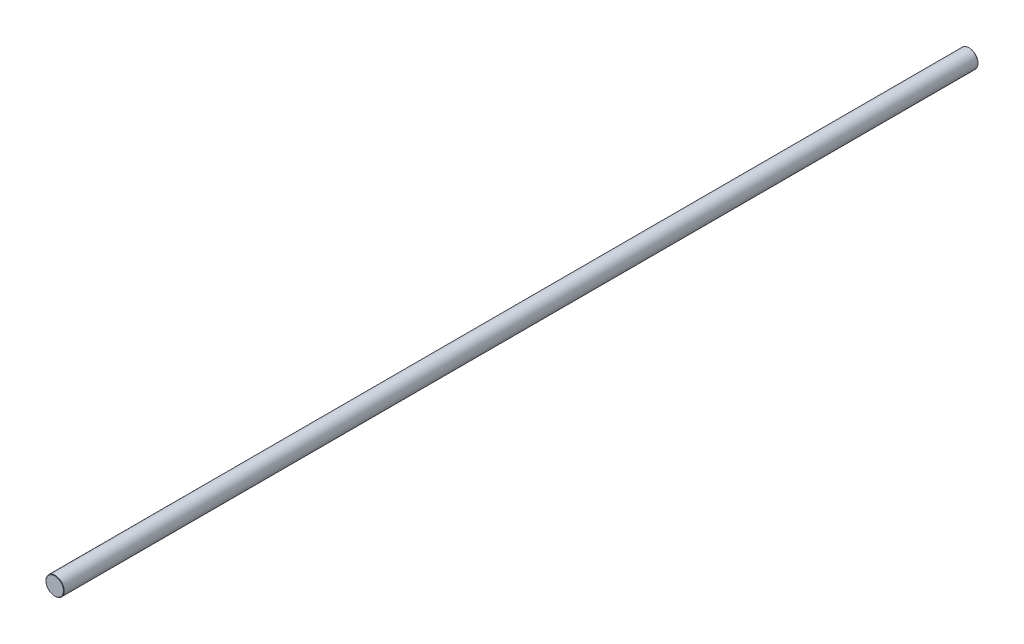
ISO-10303-21;
HEADER;
FILE_DESCRIPTION(('STEP AP214'),'2;1');
FILE_NAME('part.step','',(''),(''),'','','');
FILE_SCHEMA(('AUTOMOTIVE_DESIGN { 1 0 10303 214 1 1 1 1 }'));
ENDSEC;
DATA;
#1=APPLICATION_CONTEXT('core data for automotive mechanical design processes');
#2=APPLICATION_PROTOCOL_DEFINITION('international standard','automotive_design',2000,#1);
#3=PRODUCT_CONTEXT('',#1,'mechanical');
#4=PRODUCT('Part','Part','',(#3));
#5=PRODUCT_RELATED_PRODUCT_CATEGORY('part','',(#4));
#6=PRODUCT_DEFINITION_FORMATION('','',#4);
#7=PRODUCT_DEFINITION_CONTEXT('part definition',#1,'design');
#8=PRODUCT_DEFINITION('design','',#6,#7);
#9=PRODUCT_DEFINITION_SHAPE('','',#8);
#10=(LENGTH_UNIT() NAMED_UNIT(*) SI_UNIT(.MILLI.,.METRE.));
#11=(NAMED_UNIT(*) PLANE_ANGLE_UNIT() SI_UNIT($,.RADIAN.));
#12=(NAMED_UNIT(*) SI_UNIT($,.STERADIAN.) SOLID_ANGLE_UNIT());
#13=UNCERTAINTY_MEASURE_WITH_UNIT(LENGTH_MEASURE(1.E-05),#10,'distance_accuracy_value','');
#14=(GEOMETRIC_REPRESENTATION_CONTEXT(3) GLOBAL_UNCERTAINTY_ASSIGNED_CONTEXT((#13)) GLOBAL_UNIT_ASSIGNED_CONTEXT((#10,
#11,#12)) REPRESENTATION_CONTEXT('',''));
#15=CARTESIAN_POINT('',(0.,0.,0.));
#16=DIRECTION('',(0.,0.,1.));
#17=DIRECTION('',(1.,0.,0.));
#18=AXIS2_PLACEMENT_3D('',#15,#16,#17);
#19=CARTESIAN_POINT('',(0.,0.,638.));
#20=DIRECTION('',(0.,0.,-1.));
#21=DIRECTION('',(-1.,0.,0.));
#22=AXIS2_PLACEMENT_3D('',#19,#20,#21);
#23=CYLINDRICAL_SURFACE('',#22,12.7);
#24=CARTESIAN_POINT('',(0.,0.,-637.5));
#25=DIRECTION('',(0.,0.,1.));
#26=DIRECTION('',(1.,0.,0.));
#27=AXIS2_PLACEMENT_3D('',#24,#25,#26);
#28=CIRCLE('',#27,12.7);
#29=CARTESIAN_POINT('',(12.7,0.,-637.5));
#30=VERTEX_POINT('',#29);
#31=EDGE_CURVE('E45',#30,#30,#28,.T.);
#32=ORIENTED_EDGE('',*,*,#31,.T.);
#33=EDGE_LOOP('',(#32));
#34=FACE_BOUND('',#33,.T.);
#35=CARTESIAN_POINT('',(0.,0.,637.5));
#36=DIRECTION('',(0.,0.,1.));
#37=DIRECTION('',(1.,0.,0.));
#38=AXIS2_PLACEMENT_3D('',#35,#36,#37);
#39=CIRCLE('',#38,12.7);
#40=CARTESIAN_POINT('',(12.7,0.,637.5));
#41=VERTEX_POINT('',#40);
#42=EDGE_CURVE('E49',#41,#41,#39,.F.);
#43=ORIENTED_EDGE('',*,*,#42,.T.);
#44=EDGE_LOOP('',(#43));
#45=FACE_BOUND('',#44,.T.);
#46=ADVANCED_FACE('F33',(#34,#45),#23,.T.);
#47=CARTESIAN_POINT('',(0.,0.,638.));
#48=DIRECTION('',(0.,0.,1.));
#49=DIRECTION('',(1.,0.,0.));
#50=AXIS2_PLACEMENT_3D('',#47,#48,#49);
#51=PLANE('',#50);
#52=CARTESIAN_POINT('',(0.,0.,638.));
#53=DIRECTION('',(0.,0.,1.));
#54=DIRECTION('',(1.,0.,0.));
#55=AXIS2_PLACEMENT_3D('',#52,#53,#54);
#56=CIRCLE('',#55,12.1999999999997);
#57=CARTESIAN_POINT('',(12.1999999999997,0.,638.));
#58=VERTEX_POINT('',#57);
#59=EDGE_CURVE('E10',#58,#58,#56,.T.);
#60=ORIENTED_EDGE('',*,*,#59,.T.);
#61=EDGE_LOOP('',(#60));
#62=FACE_BOUND('',#61,.T.);
#63=ADVANCED_FACE('F65',(#62),#51,.T.);
#64=CARTESIAN_POINT('',(0.,0.,-638.));
#65=DIRECTION('',(0.,0.,1.));
#66=DIRECTION('',(1.,0.,0.));
#67=AXIS2_PLACEMENT_3D('',#64,#65,#66);
#68=PLANE('',#67);
#69=CARTESIAN_POINT('',(0.,0.,-638.));
#70=DIRECTION('',(0.,0.,1.));
#71=DIRECTION('',(1.,0.,0.));
#72=AXIS2_PLACEMENT_3D('',#69,#70,#71);
#73=CIRCLE('',#72,12.1999999999998);
#74=CARTESIAN_POINT('',(12.1999999999998,0.,-638.));
#75=VERTEX_POINT('',#74);
#76=EDGE_CURVE('E41',#75,#75,#73,.F.);
#77=ORIENTED_EDGE('',*,*,#76,.T.);
#78=EDGE_LOOP('',(#77));
#79=FACE_BOUND('',#78,.T.);
#80=ADVANCED_FACE('F62',(#79),#68,.F.);
#81=CARTESIAN_POINT('',(0.,0.,-637.5));
#82=DIRECTION('',(0.,0.,1.));
#83=DIRECTION('',(1.,0.,0.));
#84=AXIS2_PLACEMENT_3D('',#81,#82,#83);
#85=CONICAL_SURFACE('',#84,12.7,0.785398163397292);
#86=ORIENTED_EDGE('',*,*,#76,.F.);
#87=EDGE_LOOP('',(#86));
#88=FACE_BOUND('',#87,.T.);
#89=ORIENTED_EDGE('',*,*,#31,.F.);
#90=EDGE_LOOP('',(#89));
#91=FACE_BOUND('',#90,.T.);
#92=ADVANCED_FACE('F58',(#88,#91),#85,.T.);
#93=CARTESIAN_POINT('',(0.,0.,638.));
#94=DIRECTION('',(0.,0.,-1.));
#95=DIRECTION('',(-1.,0.,0.));
#96=AXIS2_PLACEMENT_3D('',#93,#94,#95);
#97=CONICAL_SURFACE('',#96,12.1999999999997,0.785398163397514);
#98=ORIENTED_EDGE('',*,*,#42,.F.);
#99=EDGE_LOOP('',(#98));
#100=FACE_BOUND('',#99,.T.);
#101=ORIENTED_EDGE('',*,*,#59,.F.);
#102=EDGE_LOOP('',(#101));
#103=FACE_BOUND('',#102,.T.);
#104=ADVANCED_FACE('F36',(#100,#103),#97,.T.);
#105=CLOSED_SHELL('',(#46,#63,#80,#92,#104));
#106=MANIFOLD_SOLID_BREP('B2',#105);
#107=ADVANCED_BREP_SHAPE_REPRESENTATION('',(#18,#106),#14);
#108=SHAPE_DEFINITION_REPRESENTATION(#9,#107);
ENDSEC;
END-ISO-10303-21;
